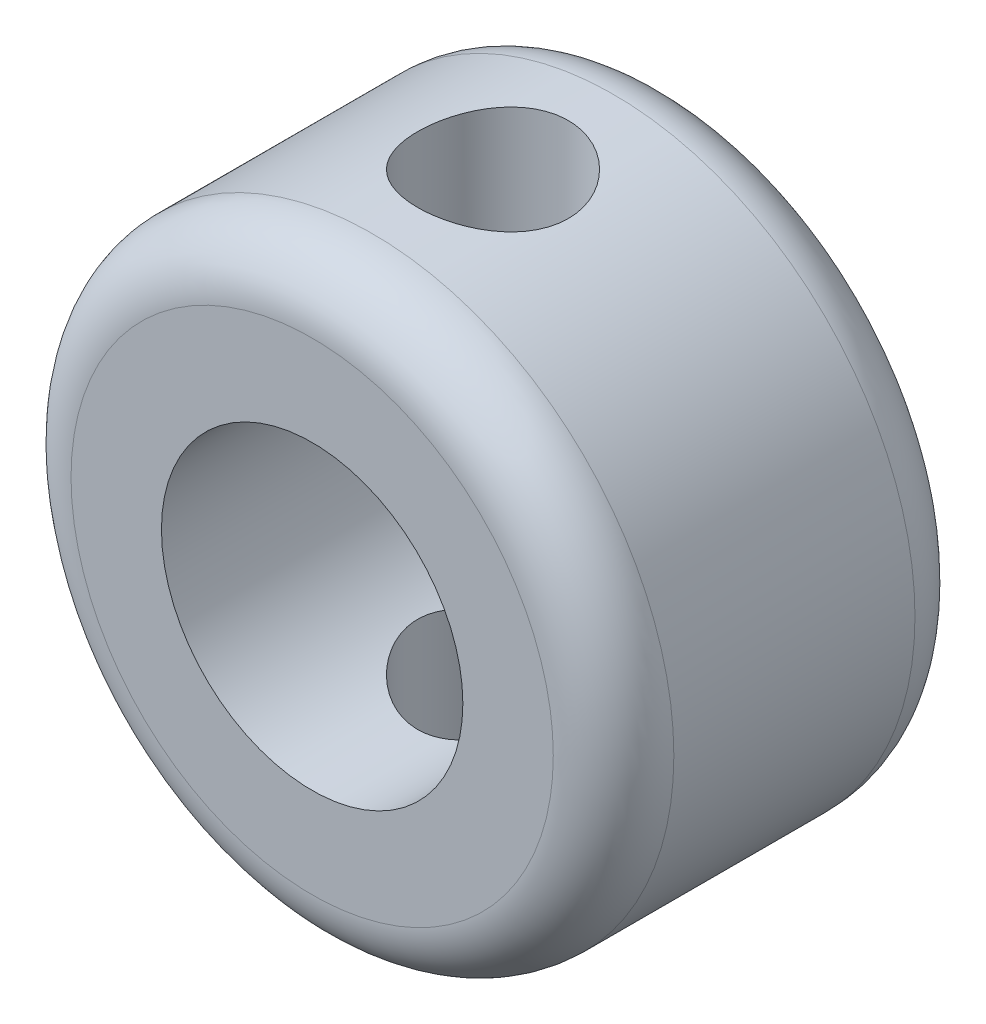
ISO-10303-21;
HEADER;
FILE_DESCRIPTION(('STEP AP214'),'2;1');
FILE_NAME('part.step','',(''),(''),'','','');
FILE_SCHEMA(('AUTOMOTIVE_DESIGN { 1 0 10303 214 1 1 1 1 }'));
ENDSEC;
DATA;
#1=APPLICATION_CONTEXT('core data for automotive mechanical design processes');
#2=APPLICATION_PROTOCOL_DEFINITION('international standard','automotive_design',2000,#1);
#3=PRODUCT_CONTEXT('',#1,'mechanical');
#4=PRODUCT('Part','Part','',(#3));
#5=PRODUCT_RELATED_PRODUCT_CATEGORY('part','',(#4));
#6=PRODUCT_DEFINITION_FORMATION('','',#4);
#7=PRODUCT_DEFINITION_CONTEXT('part definition',#1,'design');
#8=PRODUCT_DEFINITION('design','',#6,#7);
#9=PRODUCT_DEFINITION_SHAPE('','',#8);
#10=(LENGTH_UNIT() NAMED_UNIT(*) SI_UNIT(.MILLI.,.METRE.));
#11=(NAMED_UNIT(*) PLANE_ANGLE_UNIT() SI_UNIT($,.RADIAN.));
#12=(NAMED_UNIT(*) SI_UNIT($,.STERADIAN.) SOLID_ANGLE_UNIT());
#13=UNCERTAINTY_MEASURE_WITH_UNIT(LENGTH_MEASURE(1.E-05),#10,'distance_accuracy_value','');
#14=(GEOMETRIC_REPRESENTATION_CONTEXT(3) GLOBAL_UNCERTAINTY_ASSIGNED_CONTEXT((#13)) GLOBAL_UNIT_ASSIGNED_CONTEXT((#10,
#11,#12)) REPRESENTATION_CONTEXT('',''));
#15=CARTESIAN_POINT('',(0.,0.,0.));
#16=DIRECTION('',(0.,0.,1.));
#17=DIRECTION('',(1.,0.,0.));
#18=AXIS2_PLACEMENT_3D('',#15,#16,#17);
#19=CARTESIAN_POINT('',(0.,0.,6.));
#20=DIRECTION('',(0.,0.,-1.));
#21=DIRECTION('',(-1.,0.,0.));
#22=AXIS2_PLACEMENT_3D('',#19,#20,#21);
#23=CYLINDRICAL_SURFACE('',#22,5.);
#24=CARTESIAN_POINT('',(0.,-5.,4.25));
#25=CARTESIAN_POINT('',(0.069063407224776,-4.99999883223344,4.24999806188487));
#26=CARTESIAN_POINT('',(0.138148464858969,-4.99855481776524,4.24425704102184));
#27=CARTESIAN_POINT('',(0.274338603142111,-4.99293428191577,4.2214790405775));
#28=CARTESIAN_POINT('',(0.341442539058949,-4.98875621183307,4.20443565871846));
#29=CARTESIAN_POINT('',(0.471684060152147,-4.97813021943367,4.15963395544826));
#30=CARTESIAN_POINT('',(0.534826302858336,-4.97168502368406,4.1318885010706));
#31=CARTESIAN_POINT('',(0.655560109920355,-4.95721119839661,4.06651550829597));
#32=CARTESIAN_POINT('',(0.713151486957299,-4.94918251545042,4.02888763656755));
#33=CARTESIAN_POINT('',(0.822334939417433,-4.93222844659835,3.94399934195482));
#34=CARTESIAN_POINT('',(0.873796408384226,-4.92328922623777,3.89657368753402));
#35=CARTESIAN_POINT('',(0.968124106002753,-4.90561350097941,3.79378982924257));
#36=CARTESIAN_POINT('',(1.01098936412428,-4.89687701906957,3.73843073087792));
#37=CARTESIAN_POINT('',(1.08752211899919,-4.88045646416425,3.62033731105214));
#38=CARTESIAN_POINT('',(1.12104351327113,-4.87278995392171,3.55750564099133));
#39=CARTESIAN_POINT('',(1.17699742379211,-4.85957912343519,3.42687632361803));
#40=CARTESIAN_POINT('',(1.19943171286611,-4.85403446393991,3.35907947222853));
#41=CARTESIAN_POINT('',(1.23212903067024,-4.84583730597959,3.2218804181646));
#42=CARTESIAN_POINT('',(1.24262689027778,-4.84312909229522,3.15253758662517));
#43=CARTESIAN_POINT('',(1.25188481255654,-4.84074468781451,3.01302619248835));
#44=CARTESIAN_POINT('',(1.25064678484831,-4.8410680037387,2.94285776608449));
#45=CARTESIAN_POINT('',(1.2366554371994,-4.84466004580515,2.8054868268796));
#46=CARTESIAN_POINT('',(1.22418195015877,-4.84785719168233,2.73825364877909));
#47=CARTESIAN_POINT('',(1.18852015575259,-4.85672258063736,2.60686579090726));
#48=CARTESIAN_POINT('',(1.16533108505785,-4.8623909997558,2.54271133080918));
#49=CARTESIAN_POINT('',(1.10865789828096,-4.87562594920156,2.41855165312328));
#50=CARTESIAN_POINT('',(1.07507222269409,-4.88321106224518,2.35859485684204));
#51=CARTESIAN_POINT('',(0.998630230012462,-4.89941425705322,2.2450677418693));
#52=CARTESIAN_POINT('',(0.955772290674032,-4.90803251945613,2.19149854327729));
#53=CARTESIAN_POINT('',(0.860552853901015,-4.92563233783151,2.090663653588));
#54=CARTESIAN_POINT('',(0.807955215138216,-4.93461724564976,2.04362125828221));
#55=CARTESIAN_POINT('',(0.695509931253083,-4.95171637982322,1.95898229794675));
#56=CARTESIAN_POINT('',(0.63566206475662,-4.95983057957846,1.92138602144703));
#57=CARTESIAN_POINT('',(0.51009657390116,-4.97431443411819,1.85662451147968));
#58=CARTESIAN_POINT('',(0.44435949434052,-4.98067800106438,1.82949554978798));
#59=CARTESIAN_POINT('',(0.309063340119069,-4.99089930826182,1.78673557857536));
#60=CARTESIAN_POINT('',(0.239504999292071,-4.99475752782734,1.77110236965155));
#61=CARTESIAN_POINT('',(0.100449975325022,-4.99946249392812,1.75211869536764));
#62=CARTESIAN_POINT('',(0.0309972666568413,-5.00038377923566,1.74846414493725));
#63=CARTESIAN_POINT('',(-0.107527395667924,-4.99932337345376,1.75270750171291));
#64=CARTESIAN_POINT('',(-0.176599383037163,-4.99734194368205,1.76060436899928));
#65=CARTESIAN_POINT('',(-0.31134522398041,-4.99074650939464,1.78747575699282));
#66=CARTESIAN_POINT('',(-0.377054265807295,-4.98617195154843,1.80628438623082));
#67=CARTESIAN_POINT('',(-0.504381077043759,-4.97490588861778,1.85425590335704));
#68=CARTESIAN_POINT('',(-0.565998432527195,-4.9682141697491,1.88341983692764));
#69=CARTESIAN_POINT('',(-0.684602612024873,-4.95327756605259,1.95186344072894));
#70=CARTESIAN_POINT('',(-0.741487868196525,-4.94500722805777,1.9913134269973));
#71=CARTESIAN_POINT('',(-0.847938844702705,-4.92787090989516,2.07899159066414));
#72=CARTESIAN_POINT('',(-0.897503299144173,-4.91900482709754,2.12722128301409));
#73=CARTESIAN_POINT('',(-0.989158806727275,-4.90140797467309,2.23250163403705));
#74=CARTESIAN_POINT('',(-1.03103655635169,-4.89268586822734,2.28973975250202));
#75=CARTESIAN_POINT('',(-1.10459229917725,-4.87660731981032,2.41061052872143));
#76=CARTESIAN_POINT('',(-1.13627074513161,-4.86925081722522,2.47424290246646));
#77=CARTESIAN_POINT('',(-1.18829285050774,-4.85681745612221,2.60575476867756));
#78=CARTESIAN_POINT('',(-1.20870366387839,-4.85172712743255,2.67360635695334));
#79=CARTESIAN_POINT('',(-1.23778804996148,-4.84438953408486,2.81192469824092));
#80=CARTESIAN_POINT('',(-1.24646418956555,-4.84214164766613,2.88239087586041));
#81=CARTESIAN_POINT('',(-1.25169882527833,-4.84079084336631,3.02176751987934));
#82=CARTESIAN_POINT('',(-1.2485982481501,-4.8415994394022,3.09066452927061));
#83=CARTESIAN_POINT('',(-1.23114773192739,-4.84606590839869,3.22691990722332));
#84=CARTESIAN_POINT('',(-1.21679801890564,-4.84972372409881,3.29427830667804));
#85=CARTESIAN_POINT('',(-1.17744276620233,-4.85942717235602,3.42517371588784));
#86=CARTESIAN_POINT('',(-1.15250117056698,-4.86545846030258,3.48873108770017));
#87=CARTESIAN_POINT('',(-1.09272076133756,-4.87923129770691,3.61080448559474));
#88=CARTESIAN_POINT('',(-1.05788057502849,-4.88697308433977,3.6693198109891));
#89=CARTESIAN_POINT('',(-0.97822312386428,-4.90354695219593,3.78129552416835));
#90=CARTESIAN_POINT('',(-0.933169302426879,-4.91240220693131,3.8345842278533));
#91=CARTESIAN_POINT('',(-0.834824475991446,-4.93006689371905,3.93295587066284));
#92=CARTESIAN_POINT('',(-0.781531517717622,-4.93887631439216,3.97803685842747));
#93=CARTESIAN_POINT('',(-0.667056322252158,-4.95564713039719,4.05950942380384));
#94=CARTESIAN_POINT('',(-0.605748685263656,-4.9635902780489,4.09572884472632));
#95=CARTESIAN_POINT('',(-0.47772171625873,-4.97754104145932,4.15728955245044));
#96=CARTESIAN_POINT('',(-0.41100630286395,-4.98355004333151,4.18263863387378));
#97=CARTESIAN_POINT('',(-0.28700854436956,-4.99206716304618,4.21797652527471));
#98=CARTESIAN_POINT('',(-0.230316809090057,-4.99502154210576,4.22995936921119));
#99=CARTESIAN_POINT('',(-0.11575505961357,-4.9989883769329,4.24597161968495));
#100=CARTESIAN_POINT('',(-0.057885134368847,-5.00000097875745,4.25000162442108));
#101=CARTESIAN_POINT('',(0.,-5.,4.25));
#102=B_SPLINE_CURVE_WITH_KNOTS('',3,(#24,#25,#26,#27,#28,#29,#30,#31,#32,#33,#34,#35,#36,#37,
#38,#39,#40,#41,#42,#43,#44,#45,#46,#47,#48,#49,#50,#51,#52,#53,#54,#55,#56,#57,#58,#59,#60,#61,
#62,#63,#64,#65,#66,#67,#68,#69,#70,#71,#72,#73,#74,#75,#76,#77,#78,#79,#80,#81,#82,#83,#84,#85,
#86,#87,#88,#89,#90,#91,#92,#93,#94,#95,#96,#97,#98,#99,#100,#101),.UNSPECIFIED.,.T.,.F.,(4,2,2,
2,2,2,2,2,2,2,2,2,2,2,2,2,2,2,2,2,2,2,2,2,2,2,2,2,2,2,2,2,2,2,2,2,2,2,4),(0.,0.206978093726575,
0.414073531469916,0.620920751905088,0.827774950141106,1.03845362864282,1.24915607983385,
1.46298872954839,1.6767871764114,1.88630245916192,2.09578365093914,2.30018747505848,
2.50460586221699,2.71108773228233,2.91760575696802,3.13001250807516,3.34242574631873,
3.55556857507595,3.76867061407202,3.97631924124397,4.18394917593952,4.38850228761698,
4.59307606101909,4.80127989637793,5.00951969173349,5.2228709100373,5.4362126562459,
5.6482687884503,5.8602785271034,6.06619816998844,6.27211367463362,6.47680333799539,
6.68152140114085,6.89157980341592,7.10168808142015,7.3156015458299,7.52936136517792,
7.70285202451791,7.876329633692),.UNSPECIFIED.);
#103=CARTESIAN_POINT('',(0.,-5.,4.25));
#104=VERTEX_POINT('',#103);
#105=EDGE_CURVE('E92',#104,#104,#102,.T.);
#106=ORIENTED_EDGE('',*,*,#105,.T.);
#107=EDGE_LOOP('',(#106));
#108=FACE_BOUND('',#107,.T.);
#109=CARTESIAN_POINT('',(0.,5.,4.25));
#110=CARTESIAN_POINT('',(-0.069063407224776,4.99999883223344,4.24999806188487));
#111=CARTESIAN_POINT('',(-0.138148464858969,4.99855481776524,4.24425704102184));
#112=CARTESIAN_POINT('',(-0.274338603142111,4.99293428191577,4.2214790405775));
#113=CARTESIAN_POINT('',(-0.341442539058949,4.98875621183307,4.20443565871846));
#114=CARTESIAN_POINT('',(-0.471684060152147,4.97813021943367,4.15963395544826));
#115=CARTESIAN_POINT('',(-0.534826302858336,4.97168502368406,4.1318885010706));
#116=CARTESIAN_POINT('',(-0.655560109920355,4.95721119839661,4.06651550829597));
#117=CARTESIAN_POINT('',(-0.713151486957299,4.94918251545042,4.02888763656755));
#118=CARTESIAN_POINT('',(-0.822334939417433,4.93222844659835,3.94399934195482));
#119=CARTESIAN_POINT('',(-0.873796408384226,4.92328922623777,3.89657368753402));
#120=CARTESIAN_POINT('',(-0.968124106002753,4.90561350097941,3.79378982924257));
#121=CARTESIAN_POINT('',(-1.01098936412428,4.89687701906957,3.73843073087792));
#122=CARTESIAN_POINT('',(-1.08752211899919,4.88045646416425,3.62033731105214));
#123=CARTESIAN_POINT('',(-1.12104351327113,4.87278995392171,3.55750564099133));
#124=CARTESIAN_POINT('',(-1.17699742379211,4.85957912343519,3.42687632361803));
#125=CARTESIAN_POINT('',(-1.19943171286611,4.85403446393991,3.35907947222853));
#126=CARTESIAN_POINT('',(-1.23212903067024,4.84583730597959,3.2218804181646));
#127=CARTESIAN_POINT('',(-1.24262689027778,4.84312909229522,3.15253758662517));
#128=CARTESIAN_POINT('',(-1.25188481255654,4.84074468781451,3.01302619248835));
#129=CARTESIAN_POINT('',(-1.25064678484831,4.8410680037387,2.94285776608449));
#130=CARTESIAN_POINT('',(-1.2366554371994,4.84466004580515,2.8054868268796));
#131=CARTESIAN_POINT('',(-1.22418195015877,4.84785719168233,2.73825364877909));
#132=CARTESIAN_POINT('',(-1.18852015575259,4.85672258063736,2.60686579090726));
#133=CARTESIAN_POINT('',(-1.16533108505785,4.8623909997558,2.54271133080918));
#134=CARTESIAN_POINT('',(-1.10865789828096,4.87562594920156,2.41855165312328));
#135=CARTESIAN_POINT('',(-1.07507222269409,4.88321106224518,2.35859485684204));
#136=CARTESIAN_POINT('',(-0.998630230012462,4.89941425705322,2.2450677418693));
#137=CARTESIAN_POINT('',(-0.955772290674032,4.90803251945613,2.19149854327729));
#138=CARTESIAN_POINT('',(-0.860552853901015,4.92563233783151,2.090663653588));
#139=CARTESIAN_POINT('',(-0.807955215138216,4.93461724564976,2.04362125828221));
#140=CARTESIAN_POINT('',(-0.695509931253083,4.95171637982322,1.95898229794675));
#141=CARTESIAN_POINT('',(-0.63566206475662,4.95983057957846,1.92138602144703));
#142=CARTESIAN_POINT('',(-0.51009657390116,4.97431443411819,1.85662451147968));
#143=CARTESIAN_POINT('',(-0.44435949434052,4.98067800106438,1.82949554978798));
#144=CARTESIAN_POINT('',(-0.309063340119069,4.99089930826182,1.78673557857536));
#145=CARTESIAN_POINT('',(-0.239504999292071,4.99475752782734,1.77110236965155));
#146=CARTESIAN_POINT('',(-0.100449975325022,4.99946249392812,1.75211869536764));
#147=CARTESIAN_POINT('',(-0.0309972666568413,5.00038377923566,1.74846414493725));
#148=CARTESIAN_POINT('',(0.107527395667924,4.99932337345376,1.75270750171291));
#149=CARTESIAN_POINT('',(0.176599383037163,4.99734194368205,1.76060436899928));
#150=CARTESIAN_POINT('',(0.31134522398041,4.99074650939464,1.78747575699282));
#151=CARTESIAN_POINT('',(0.377054265807295,4.98617195154843,1.80628438623082));
#152=CARTESIAN_POINT('',(0.504381077043759,4.97490588861778,1.85425590335704));
#153=CARTESIAN_POINT('',(0.565998432527195,4.9682141697491,1.88341983692764));
#154=CARTESIAN_POINT('',(0.684602612024873,4.95327756605259,1.95186344072894));
#155=CARTESIAN_POINT('',(0.741487868196525,4.94500722805777,1.9913134269973));
#156=CARTESIAN_POINT('',(0.847938844702705,4.92787090989516,2.07899159066414));
#157=CARTESIAN_POINT('',(0.897503299144173,4.91900482709754,2.12722128301409));
#158=CARTESIAN_POINT('',(0.989158806727275,4.90140797467309,2.23250163403705));
#159=CARTESIAN_POINT('',(1.03103655635169,4.89268586822734,2.28973975250202));
#160=CARTESIAN_POINT('',(1.10459229917725,4.87660731981032,2.41061052872143));
#161=CARTESIAN_POINT('',(1.13627074513161,4.86925081722522,2.47424290246646));
#162=CARTESIAN_POINT('',(1.18829285050774,4.85681745612221,2.60575476867756));
#163=CARTESIAN_POINT('',(1.20870366387839,4.85172712743255,2.67360635695334));
#164=CARTESIAN_POINT('',(1.23778804996148,4.84438953408486,2.81192469824092));
#165=CARTESIAN_POINT('',(1.24646418956555,4.84214164766613,2.88239087586041));
#166=CARTESIAN_POINT('',(1.25169882527833,4.84079084336631,3.02176751987934));
#167=CARTESIAN_POINT('',(1.2485982481501,4.8415994394022,3.09066452927061));
#168=CARTESIAN_POINT('',(1.23114773192739,4.84606590839869,3.22691990722332));
#169=CARTESIAN_POINT('',(1.21679801890564,4.84972372409881,3.29427830667804));
#170=CARTESIAN_POINT('',(1.17744276620233,4.85942717235602,3.42517371588784));
#171=CARTESIAN_POINT('',(1.15250117056698,4.86545846030258,3.48873108770017));
#172=CARTESIAN_POINT('',(1.09272076133756,4.87923129770691,3.61080448559474));
#173=CARTESIAN_POINT('',(1.05788057502849,4.88697308433977,3.6693198109891));
#174=CARTESIAN_POINT('',(0.97822312386428,4.90354695219593,3.78129552416835));
#175=CARTESIAN_POINT('',(0.933169302426879,4.91240220693131,3.8345842278533));
#176=CARTESIAN_POINT('',(0.834824475991446,4.93006689371905,3.93295587066284));
#177=CARTESIAN_POINT('',(0.781531517717622,4.93887631439216,3.97803685842747));
#178=CARTESIAN_POINT('',(0.667056322252158,4.95564713039719,4.05950942380384));
#179=CARTESIAN_POINT('',(0.605748685263656,4.9635902780489,4.09572884472632));
#180=CARTESIAN_POINT('',(0.47772171625873,4.97754104145932,4.15728955245044));
#181=CARTESIAN_POINT('',(0.41100630286395,4.98355004333151,4.18263863387378));
#182=CARTESIAN_POINT('',(0.28700854436956,4.99206716304618,4.21797652527471));
#183=CARTESIAN_POINT('',(0.230316809090057,4.99502154210576,4.22995936921119));
#184=CARTESIAN_POINT('',(0.11575505961357,4.9989883769329,4.24597161968495));
#185=CARTESIAN_POINT('',(0.057885134368847,5.00000097875745,4.25000162442108));
#186=CARTESIAN_POINT('',(0.,5.,4.25));
#187=B_SPLINE_CURVE_WITH_KNOTS('',3,(#109,#110,#111,#112,#113,#114,#115,#116,#117,#118,#119,
#120,#121,#122,#123,#124,#125,#126,#127,#128,#129,#130,#131,#132,#133,#134,#135,#136,#137,#138,
#139,#140,#141,#142,#143,#144,#145,#146,#147,#148,#149,#150,#151,#152,#153,#154,#155,#156,#157,
#158,#159,#160,#161,#162,#163,#164,#165,#166,#167,#168,#169,#170,#171,#172,#173,#174,#175,#176,
#177,#178,#179,#180,#181,#182,#183,#184,#185,#186),.UNSPECIFIED.,.T.,.F.,(4,2,2,2,2,2,2,2,2,2,2,
2,2,2,2,2,2,2,2,2,2,2,2,2,2,2,2,2,2,2,2,2,2,2,2,2,2,2,4),(0.,0.206978093726575,
0.414073531469916,0.620920751905088,0.827774950141106,1.03845362864282,1.24915607983385,
1.46298872954839,1.6767871764114,1.88630245916192,2.09578365093914,2.30018747505848,
2.50460586221699,2.71108773228233,2.91760575696802,3.13001250807516,3.34242574631873,
3.55556857507595,3.76867061407202,3.97631924124397,4.18394917593952,4.38850228761698,
4.59307606101909,4.80127989637793,5.00951969173349,5.2228709100373,5.4362126562459,
5.6482687884503,5.8602785271034,6.06619816998844,6.27211367463362,6.47680333799539,
6.68152140114085,6.89157980341592,7.10168808142015,7.3156015458299,7.52936136517792,
7.70285202451791,7.876329633692),.UNSPECIFIED.);
#188=CARTESIAN_POINT('',(0.,5.,4.25));
#189=VERTEX_POINT('',#188);
#190=EDGE_CURVE('E85',#189,#189,#187,.T.);
#191=ORIENTED_EDGE('',*,*,#190,.T.);
#192=EDGE_LOOP('',(#191));
#193=FACE_BOUND('',#192,.T.);
#194=CARTESIAN_POINT('',(0.,0.,1.));
#195=DIRECTION('',(0.,0.,1.));
#196=DIRECTION('',(1.,0.,0.));
#197=AXIS2_PLACEMENT_3D('',#194,#195,#196);
#198=CIRCLE('',#197,5.);
#199=CARTESIAN_POINT('',(5.,0.,1.));
#200=VERTEX_POINT('',#199);
#201=EDGE_CURVE('E63',#200,#200,#198,.T.);
#202=ORIENTED_EDGE('',*,*,#201,.T.);
#203=EDGE_LOOP('',(#202));
#204=FACE_BOUND('',#203,.T.);
#205=CARTESIAN_POINT('',(0.,0.,5.));
#206=DIRECTION('',(0.,0.,1.));
#207=DIRECTION('',(1.,0.,0.));
#208=AXIS2_PLACEMENT_3D('',#205,#206,#207);
#209=CIRCLE('',#208,5.);
#210=CARTESIAN_POINT('',(5.,0.,5.));
#211=VERTEX_POINT('',#210);
#212=EDGE_CURVE('E119',#211,#211,#209,.F.);
#213=ORIENTED_EDGE('',*,*,#212,.T.);
#214=EDGE_LOOP('',(#213));
#215=FACE_BOUND('',#214,.T.);
#216=ADVANCED_FACE('F43',(#108,#193,#204,#215),#23,.T.);
#217=CARTESIAN_POINT('',(0.,0.,6.));
#218=DIRECTION('',(0.,0.,1.));
#219=DIRECTION('',(1.,0.,0.));
#220=AXIS2_PLACEMENT_3D('',#217,#218,#219);
#221=PLANE('',#220);
#222=CARTESIAN_POINT('',(0.,0.,6.));
#223=DIRECTION('',(0.,0.,1.));
#224=DIRECTION('',(1.,0.,0.));
#225=AXIS2_PLACEMENT_3D('',#222,#223,#224);
#226=CIRCLE('',#225,2.5);
#227=CARTESIAN_POINT('',(2.5,0.,6.));
#228=VERTEX_POINT('',#227);
#229=EDGE_CURVE('E122',#228,#228,#226,.T.);
#230=ORIENTED_EDGE('',*,*,#229,.F.);
#231=EDGE_LOOP('',(#230));
#232=FACE_BOUND('',#231,.T.);
#233=CARTESIAN_POINT('',(0.,0.,6.));
#234=DIRECTION('',(0.,0.,1.));
#235=DIRECTION('',(1.,0.,0.));
#236=AXIS2_PLACEMENT_3D('',#233,#234,#235);
#237=CIRCLE('',#236,4.);
#238=CARTESIAN_POINT('',(4.,0.,6.));
#239=VERTEX_POINT('',#238);
#240=EDGE_CURVE('E10',#239,#239,#237,.T.);
#241=ORIENTED_EDGE('',*,*,#240,.T.);
#242=EDGE_LOOP('',(#241));
#243=FACE_BOUND('',#242,.T.);
#244=ADVANCED_FACE('F100',(#232,#243),#221,.T.);
#245=CARTESIAN_POINT('',(0.,0.,0.));
#246=DIRECTION('',(0.,0.,1.));
#247=DIRECTION('',(1.,0.,0.));
#248=AXIS2_PLACEMENT_3D('',#245,#246,#247);
#249=PLANE('',#248);
#250=CARTESIAN_POINT('',(0.,0.,0.));
#251=DIRECTION('',(0.,0.,1.));
#252=DIRECTION('',(1.,0.,0.));
#253=AXIS2_PLACEMENT_3D('',#250,#251,#252);
#254=CIRCLE('',#253,2.5);
#255=CARTESIAN_POINT('',(2.5,0.,0.));
#256=VERTEX_POINT('',#255);
#257=EDGE_CURVE('E127',#256,#256,#254,.T.);
#258=ORIENTED_EDGE('',*,*,#257,.T.);
#259=EDGE_LOOP('',(#258));
#260=FACE_BOUND('',#259,.T.);
#261=CARTESIAN_POINT('',(0.,0.,0.));
#262=DIRECTION('',(0.,0.,1.));
#263=DIRECTION('',(1.,0.,0.));
#264=AXIS2_PLACEMENT_3D('',#261,#262,#263);
#265=CIRCLE('',#264,4.);
#266=CARTESIAN_POINT('',(4.,0.,0.));
#267=VERTEX_POINT('',#266);
#268=EDGE_CURVE('E57',#267,#267,#265,.F.);
#269=ORIENTED_EDGE('',*,*,#268,.T.);
#270=EDGE_LOOP('',(#269));
#271=FACE_BOUND('',#270,.T.);
#272=ADVANCED_FACE('F102',(#260,#271),#249,.F.);
#273=CARTESIAN_POINT('',(0.,0.,1.));
#274=DIRECTION('',(0.,0.,1.));
#275=DIRECTION('',(1.,0.,0.));
#276=AXIS2_PLACEMENT_3D('',#273,#274,#275);
#277=TOROIDAL_SURFACE('',#276,4.,1.);
#278=ORIENTED_EDGE('',*,*,#268,.F.);
#279=EDGE_LOOP('',(#278));
#280=FACE_BOUND('',#279,.T.);
#281=ORIENTED_EDGE('',*,*,#201,.F.);
#282=EDGE_LOOP('',(#281));
#283=FACE_BOUND('',#282,.T.);
#284=ADVANCED_FACE('F103',(#280,#283),#277,.T.);
#285=CARTESIAN_POINT('',(0.,0.,5.));
#286=DIRECTION('',(0.,0.,1.));
#287=DIRECTION('',(1.,0.,0.));
#288=AXIS2_PLACEMENT_3D('',#285,#286,#287);
#289=TOROIDAL_SURFACE('',#288,4.,1.);
#290=ORIENTED_EDGE('',*,*,#212,.F.);
#291=EDGE_LOOP('',(#290));
#292=FACE_BOUND('',#291,.T.);
#293=ORIENTED_EDGE('',*,*,#240,.F.);
#294=EDGE_LOOP('',(#293));
#295=FACE_BOUND('',#294,.T.);
#296=ADVANCED_FACE('F45',(#292,#295),#289,.T.);
#297=CARTESIAN_POINT('',(0.,0.,0.));
#298=DIRECTION('',(0.,0.,1.));
#299=DIRECTION('',(1.,0.,0.));
#300=AXIS2_PLACEMENT_3D('',#297,#298,#299);
#301=CYLINDRICAL_SURFACE('',#300,2.5);
#302=CARTESIAN_POINT('',(0.,-2.5,4.25));
#303=CARTESIAN_POINT('',(-0.065714953691233,-2.49999641755189,4.24999587210062));
#304=CARTESIAN_POINT('',(-0.131508249622541,-2.49738113774397,4.24478740859791));
#305=CARTESIAN_POINT('',(-0.261150294085531,-2.48717695046745,4.22418389957385));
#306=CARTESIAN_POINT('',(-0.32499510839188,-2.47957859786229,4.20876950875294));
#307=CARTESIAN_POINT('',(-0.448666931100718,-2.46020349254139,4.16850773922901));
#308=CARTESIAN_POINT('',(-0.508508503673975,-2.448442989719,4.14369701968999));
#309=CARTESIAN_POINT('',(-0.623090771008206,-2.42182220644723,4.08553672329382));
#310=CARTESIAN_POINT('',(-0.677831867487562,-2.40696217041913,4.05218781968893));
#311=CARTESIAN_POINT('',(-0.784384772202399,-2.37445322822571,3.97560343814338));
#312=CARTESIAN_POINT('',(-0.83581901390264,-2.3566899890942,3.93189190095045));
#313=CARTESIAN_POINT('',(-0.930974306083722,-2.3207496280843,3.83684815094121));
#314=CARTESIAN_POINT('',(-0.974689478883458,-2.30257220261294,3.78551018528445));
#315=CARTESIAN_POINT('',(-1.05656500056285,-2.26623688996684,3.67189581309577));
#316=CARTESIAN_POINT('',(-1.09403166943955,-2.24818983712665,3.60907987706761));
#317=CARTESIAN_POINT('',(-1.15771028361337,-2.21607473465401,3.47704083001723));
#318=CARTESIAN_POINT('',(-1.18393026870792,-2.20200384508737,3.40782233909656));
#319=CARTESIAN_POINT('',(-1.22266555273574,-2.18072333797261,3.2691686182226));
#320=CARTESIAN_POINT('',(-1.23590732135055,-2.17315339479642,3.19999443491576));
#321=CARTESIAN_POINT('',(-1.25053374163606,-2.1647736243566,3.06002645277565));
#322=CARTESIAN_POINT('',(-1.25193011046634,-2.1639571167911,2.98923432391106));
#323=CARTESIAN_POINT('',(-1.24335910896537,-2.16888662821561,2.85714246960579));
#324=CARTESIAN_POINT('',(-1.23473069942103,-2.17385954577517,2.79571996097119));
#325=CARTESIAN_POINT('',(-1.20867481132117,-2.18845285917313,2.6753476132837));
#326=CARTESIAN_POINT('',(-1.19124452987206,-2.1980747353972,2.61639856836836));
#327=CARTESIAN_POINT('',(-1.1477622254825,-2.22109345515926,2.50096358429293));
#328=CARTESIAN_POINT('',(-1.12151883389499,-2.23457300829998,2.44456700151776));
#329=CARTESIAN_POINT('',(-1.061302109585,-2.26379255351755,2.33670713426249));
#330=CARTESIAN_POINT('',(-1.02732530476558,-2.27953355975238,2.28524608049989));
#331=CARTESIAN_POINT('',(-0.947582568640986,-2.31391447379107,2.18184843407097));
#332=CARTESIAN_POINT('',(-0.900868072961602,-2.33266887795933,2.1306789080298));
#333=CARTESIAN_POINT('',(-0.799444473426717,-2.36934529125509,2.03658072676137));
#334=CARTESIAN_POINT('',(-0.744731570717857,-2.38726689948501,1.99365600995765));
#335=CARTESIAN_POINT('',(-0.625645632289811,-2.42127484103705,1.91539292371284));
#336=CARTESIAN_POINT('',(-0.560941989499261,-2.43723730202509,1.88049940944282));
#337=CARTESIAN_POINT('',(-0.425582769360996,-2.46447351401553,1.82237871369624));
#338=CARTESIAN_POINT('',(-0.354931970331596,-2.47575098679441,1.79914226873104));
#339=CARTESIAN_POINT('',(-0.215958114575877,-2.49155417176795,1.76690574535416));
#340=CARTESIAN_POINT('',(-0.147926913185405,-2.4965617287664,1.75688595531653));
#341=CARTESIAN_POINT('',(-0.0109744999366917,-2.50091266823877,1.74816908608189));
#342=CARTESIAN_POINT('',(0.057946274837377,-2.5002587340164,1.74946664295065));
#343=CARTESIAN_POINT('',(0.189041214982492,-2.49363990316801,1.76275836052344));
#344=CARTESIAN_POINT('',(0.251324260062443,-2.48809057110237,1.77391566591254));
#345=CARTESIAN_POINT('',(0.373008615377396,-2.47277714143524,1.80529758986886));
#346=CARTESIAN_POINT('',(0.432409607113746,-2.46301257917916,1.8255232080667));
#347=CARTESIAN_POINT('',(0.548610760562082,-2.43980314267087,1.87499808304147));
#348=CARTESIAN_POINT('',(0.605287996257692,-2.42626102212424,1.90448881264602));
#349=CARTESIAN_POINT('',(0.713076702123652,-2.39679967896386,1.97138441955755));
#350=CARTESIAN_POINT('',(0.764185787219103,-2.38087944457231,2.00879266824179));
#351=CARTESIAN_POINT('',(0.864709611613317,-2.3463527667183,2.09470053166609));
#352=CARTESIAN_POINT('',(0.913465097280799,-2.32763606060552,2.14392858556696));
#353=CARTESIAN_POINT('',(1.00232040139155,-2.29077989504843,2.24990643908663));
#354=CARTESIAN_POINT('',(1.04241423211355,-2.27264084226908,2.30666139852047));
#355=CARTESIAN_POINT('',(1.11463489312212,-2.23813990282585,2.42955456775039));
#356=CARTESIAN_POINT('',(1.1462818698483,-2.2219066207934,2.49601408276074));
#357=CARTESIAN_POINT('',(1.19760353251725,-2.19467590460158,2.63438758461565));
#358=CARTESIAN_POINT('',(1.21729364485946,-2.18367172800773,2.70629440812648));
#359=CARTESIAN_POINT('',(1.2423271093121,-2.16951876260833,2.84613777857681));
#360=CARTESIAN_POINT('',(1.24886624550108,-2.16571729325614,2.9137928167863));
#361=CARTESIAN_POINT('',(1.25086144297598,-2.16456693307719,3.04930883396341));
#362=CARTESIAN_POINT('',(1.2463223082805,-2.16721524534441,3.11716971092429));
#363=CARTESIAN_POINT('',(1.22740765699033,-2.17797327562531,3.24435437691502));
#364=CARTESIAN_POINT('',(1.2140103929285,-2.18553868102992,3.3038755876805));
#365=CARTESIAN_POINT('',(1.17896919778081,-2.20463770234897,3.41976014928088));
#366=CARTESIAN_POINT('',(1.15732261394976,-2.21617259462095,3.47612247761496));
#367=CARTESIAN_POINT('',(1.10476968162585,-2.2428566295566,3.58828106373326));
#368=CARTESIAN_POINT('',(1.07333892227057,-2.25819652995238,3.64378487728713));
#369=CARTESIAN_POINT('',(1.00268871454579,-2.29044164543238,3.74909317022573));
#370=CARTESIAN_POINT('',(0.96346521404831,-2.30734767243153,3.79889466314811));
#371=CARTESIAN_POINT('',(0.872754158330802,-2.34327903949141,3.89767747794702));
#372=CARTESIAN_POINT('',(0.820355528762714,-2.36231229139336,3.9458238779524));
#373=CARTESIAN_POINT('',(0.707693507775349,-2.3984719031886,4.03282872927954));
#374=CARTESIAN_POINT('',(0.647425904070981,-2.4155972326005,4.07168217428286));
#375=CARTESIAN_POINT('',(0.519914496024933,-2.44622511981379,4.13904545345276));
#376=CARTESIAN_POINT('',(0.452624379918268,-2.45970120703636,4.16748021176429));
#377=CARTESIAN_POINT('',(0.313427626617739,-2.48126676704332,4.21226020989869));
#378=CARTESIAN_POINT('',(0.241534749528957,-2.48937154216165,4.22863980853697));
#379=CARTESIAN_POINT('',(0.140752433104229,-2.49619327387079,4.24237176384481));
#380=CARTESIAN_POINT('',(0.112702349299373,-2.49761706674002,4.24522830107952));
#381=CARTESIAN_POINT('',(0.056439664758947,-2.49952121222331,4.24904333189601));
#382=CARTESIAN_POINT('',(0.0282270595592267,-2.50000153879704,4.250001773089));
#383=CARTESIAN_POINT('',(0.,-2.5,4.25));
#384=B_SPLINE_CURVE_WITH_KNOTS('',3,(#302,#303,#304,#305,#306,#307,#308,#309,#310,#311,#312,
#313,#314,#315,#316,#317,#318,#319,#320,#321,#322,#323,#324,#325,#326,#327,#328,#329,#330,#331,
#332,#333,#334,#335,#336,#337,#338,#339,#340,#341,#342,#343,#344,#345,#346,#347,#348,#349,#350,
#351,#352,#353,#354,#355,#356,#357,#358,#359,#360,#361,#362,#363,#364,#365,#366,#367,#368,#369,
#370,#371,#372,#373,#374,#375,#376,#377,#378,#379,#380,#381,#382,#383),.UNSPECIFIED.,.T.,.F.,(4,
2,2,2,2,2,2,2,2,2,2,2,2,2,2,2,2,2,2,2,2,2,2,2,2,2,2,2,2,2,2,2,2,2,2,2,2,2,2,2,4),(0.,
0.197030321775365,0.394435187136497,0.591077694365373,0.78770470072696,0.996227198397611,
1.20490779706754,1.42977158038441,1.65447434872851,1.86572515175287,2.07676696661276,
2.26257140511651,2.44843504907098,2.63862800210609,2.82890651575277,3.04331176667348,
3.25781918248358,3.48228777768051,3.7065777114035,3.91229113089182,4.11790705639345,
4.30758633132653,4.49728652038664,4.69241070034873,4.88761813435424,5.10199513305524,
5.3165198576929,5.54143352699593,5.76605639925972,5.96911634372967,6.17208824825007,
6.35572412805228,6.53941910979598,6.73545570969518,6.93159451423697,7.15156553440623,
7.37165479220716,7.59330017078657,7.81431135781163,7.89894100172122,7.98357298143559),.UNSPECIFIED.);
#385=CARTESIAN_POINT('',(0.,-2.5,4.25));
#386=VERTEX_POINT('',#385);
#387=EDGE_CURVE('E47',#386,#386,#384,.T.);
#388=ORIENTED_EDGE('',*,*,#387,.T.);
#389=EDGE_LOOP('',(#388));
#390=FACE_BOUND('',#389,.T.);
#391=CARTESIAN_POINT('',(0.,2.5,4.25));
#392=CARTESIAN_POINT('',(0.065714953691233,2.49999641755189,4.24999587210062));
#393=CARTESIAN_POINT('',(0.131508249622541,2.49738113774397,4.24478740859791));
#394=CARTESIAN_POINT('',(0.261150294085531,2.48717695046745,4.22418389957385));
#395=CARTESIAN_POINT('',(0.32499510839188,2.47957859786229,4.20876950875294));
#396=CARTESIAN_POINT('',(0.448666931100718,2.46020349254139,4.16850773922901));
#397=CARTESIAN_POINT('',(0.508508503673975,2.448442989719,4.14369701968999));
#398=CARTESIAN_POINT('',(0.623090771008206,2.42182220644723,4.08553672329382));
#399=CARTESIAN_POINT('',(0.677831867487562,2.40696217041913,4.05218781968893));
#400=CARTESIAN_POINT('',(0.784384772202399,2.37445322822571,3.97560343814338));
#401=CARTESIAN_POINT('',(0.83581901390264,2.3566899890942,3.93189190095045));
#402=CARTESIAN_POINT('',(0.930974306083722,2.3207496280843,3.83684815094121));
#403=CARTESIAN_POINT('',(0.974689478883458,2.30257220261294,3.78551018528445));
#404=CARTESIAN_POINT('',(1.05656500056285,2.26623688996684,3.67189581309577));
#405=CARTESIAN_POINT('',(1.09403166943955,2.24818983712665,3.60907987706761));
#406=CARTESIAN_POINT('',(1.15771028361337,2.21607473465401,3.47704083001723));
#407=CARTESIAN_POINT('',(1.18393026870792,2.20200384508737,3.40782233909656));
#408=CARTESIAN_POINT('',(1.22266555273574,2.18072333797261,3.2691686182226));
#409=CARTESIAN_POINT('',(1.23590732135055,2.17315339479642,3.19999443491576));
#410=CARTESIAN_POINT('',(1.25053374163606,2.1647736243566,3.06002645277565));
#411=CARTESIAN_POINT('',(1.25193011046634,2.1639571167911,2.98923432391106));
#412=CARTESIAN_POINT('',(1.24335910896537,2.16888662821561,2.85714246960579));
#413=CARTESIAN_POINT('',(1.23473069942103,2.17385954577517,2.79571996097119));
#414=CARTESIAN_POINT('',(1.20867481132117,2.18845285917313,2.6753476132837));
#415=CARTESIAN_POINT('',(1.19124452987206,2.1980747353972,2.61639856836836));
#416=CARTESIAN_POINT('',(1.1477622254825,2.22109345515926,2.50096358429293));
#417=CARTESIAN_POINT('',(1.12151883389499,2.23457300829998,2.44456700151776));
#418=CARTESIAN_POINT('',(1.061302109585,2.26379255351755,2.33670713426249));
#419=CARTESIAN_POINT('',(1.02732530476558,2.27953355975238,2.28524608049989));
#420=CARTESIAN_POINT('',(0.947582568640986,2.31391447379107,2.18184843407097));
#421=CARTESIAN_POINT('',(0.900868072961602,2.33266887795933,2.1306789080298));
#422=CARTESIAN_POINT('',(0.799444473426717,2.36934529125509,2.03658072676137));
#423=CARTESIAN_POINT('',(0.744731570717857,2.38726689948501,1.99365600995765));
#424=CARTESIAN_POINT('',(0.625645632289811,2.42127484103705,1.91539292371284));
#425=CARTESIAN_POINT('',(0.560941989499261,2.43723730202509,1.88049940944282));
#426=CARTESIAN_POINT('',(0.425582769360996,2.46447351401553,1.82237871369624));
#427=CARTESIAN_POINT('',(0.354931970331596,2.47575098679441,1.79914226873104));
#428=CARTESIAN_POINT('',(0.215958114575877,2.49155417176795,1.76690574535416));
#429=CARTESIAN_POINT('',(0.147926913185405,2.4965617287664,1.75688595531653));
#430=CARTESIAN_POINT('',(0.0109744999366917,2.50091266823877,1.74816908608189));
#431=CARTESIAN_POINT('',(-0.057946274837377,2.5002587340164,1.74946664295065));
#432=CARTESIAN_POINT('',(-0.189041214982492,2.49363990316801,1.76275836052344));
#433=CARTESIAN_POINT('',(-0.251324260062443,2.48809057110237,1.77391566591254));
#434=CARTESIAN_POINT('',(-0.373008615377396,2.47277714143524,1.80529758986886));
#435=CARTESIAN_POINT('',(-0.432409607113746,2.46301257917916,1.8255232080667));
#436=CARTESIAN_POINT('',(-0.548610760562082,2.43980314267087,1.87499808304147));
#437=CARTESIAN_POINT('',(-0.605287996257692,2.42626102212424,1.90448881264602));
#438=CARTESIAN_POINT('',(-0.713076702123652,2.39679967896386,1.97138441955755));
#439=CARTESIAN_POINT('',(-0.764185787219103,2.38087944457231,2.00879266824179));
#440=CARTESIAN_POINT('',(-0.864709611613317,2.3463527667183,2.09470053166609));
#441=CARTESIAN_POINT('',(-0.913465097280799,2.32763606060552,2.14392858556696));
#442=CARTESIAN_POINT('',(-1.00232040139155,2.29077989504843,2.24990643908663));
#443=CARTESIAN_POINT('',(-1.04241423211355,2.27264084226908,2.30666139852047));
#444=CARTESIAN_POINT('',(-1.11463489312212,2.23813990282585,2.42955456775039));
#445=CARTESIAN_POINT('',(-1.1462818698483,2.2219066207934,2.49601408276074));
#446=CARTESIAN_POINT('',(-1.19760353251725,2.19467590460158,2.63438758461565));
#447=CARTESIAN_POINT('',(-1.21729364485946,2.18367172800773,2.70629440812648));
#448=CARTESIAN_POINT('',(-1.2423271093121,2.16951876260833,2.84613777857681));
#449=CARTESIAN_POINT('',(-1.24886624550108,2.16571729325614,2.9137928167863));
#450=CARTESIAN_POINT('',(-1.25086144297598,2.16456693307719,3.04930883396341));
#451=CARTESIAN_POINT('',(-1.2463223082805,2.16721524534441,3.11716971092429));
#452=CARTESIAN_POINT('',(-1.22740765699033,2.17797327562531,3.24435437691502));
#453=CARTESIAN_POINT('',(-1.2140103929285,2.18553868102992,3.3038755876805));
#454=CARTESIAN_POINT('',(-1.17896919778081,2.20463770234897,3.41976014928088));
#455=CARTESIAN_POINT('',(-1.15732261394976,2.21617259462095,3.47612247761496));
#456=CARTESIAN_POINT('',(-1.10476968162585,2.2428566295566,3.58828106373326));
#457=CARTESIAN_POINT('',(-1.07333892227057,2.25819652995238,3.64378487728713));
#458=CARTESIAN_POINT('',(-1.00268871454579,2.29044164543238,3.74909317022573));
#459=CARTESIAN_POINT('',(-0.96346521404831,2.30734767243153,3.79889466314811));
#460=CARTESIAN_POINT('',(-0.872754158330802,2.34327903949141,3.89767747794702));
#461=CARTESIAN_POINT('',(-0.820355528762714,2.36231229139336,3.9458238779524));
#462=CARTESIAN_POINT('',(-0.707693507775349,2.3984719031886,4.03282872927954));
#463=CARTESIAN_POINT('',(-0.647425904070981,2.4155972326005,4.07168217428286));
#464=CARTESIAN_POINT('',(-0.519914496024933,2.44622511981379,4.13904545345276));
#465=CARTESIAN_POINT('',(-0.452624379918268,2.45970120703636,4.16748021176429));
#466=CARTESIAN_POINT('',(-0.313427626617739,2.48126676704332,4.21226020989869));
#467=CARTESIAN_POINT('',(-0.241534749528957,2.48937154216165,4.22863980853697));
#468=CARTESIAN_POINT('',(-0.140752433104229,2.49619327387079,4.24237176384481));
#469=CARTESIAN_POINT('',(-0.112702349299373,2.49761706674002,4.24522830107952));
#470=CARTESIAN_POINT('',(-0.056439664758947,2.49952121222331,4.24904333189601));
#471=CARTESIAN_POINT('',(-0.0282270595592267,2.50000153879704,4.250001773089));
#472=CARTESIAN_POINT('',(0.,2.5,4.25));
#473=B_SPLINE_CURVE_WITH_KNOTS('',3,(#391,#392,#393,#394,#395,#396,#397,#398,#399,#400,#401,
#402,#403,#404,#405,#406,#407,#408,#409,#410,#411,#412,#413,#414,#415,#416,#417,#418,#419,#420,
#421,#422,#423,#424,#425,#426,#427,#428,#429,#430,#431,#432,#433,#434,#435,#436,#437,#438,#439,
#440,#441,#442,#443,#444,#445,#446,#447,#448,#449,#450,#451,#452,#453,#454,#455,#456,#457,#458,
#459,#460,#461,#462,#463,#464,#465,#466,#467,#468,#469,#470,#471,#472),.UNSPECIFIED.,.T.,.F.,(4,
2,2,2,2,2,2,2,2,2,2,2,2,2,2,2,2,2,2,2,2,2,2,2,2,2,2,2,2,2,2,2,2,2,2,2,2,2,2,2,4),(0.,
0.197030321775365,0.394435187136497,0.591077694365373,0.78770470072696,0.996227198397611,
1.20490779706754,1.42977158038441,1.65447434872851,1.86572515175287,2.07676696661276,
2.26257140511651,2.44843504907098,2.63862800210609,2.82890651575277,3.04331176667348,
3.25781918248358,3.48228777768051,3.7065777114035,3.91229113089182,4.11790705639345,
4.30758633132653,4.49728652038664,4.69241070034873,4.88761813435424,5.10199513305524,
5.3165198576929,5.54143352699593,5.76605639925972,5.96911634372967,6.17208824825007,
6.35572412805228,6.53941910979598,6.73545570969518,6.93159451423697,7.15156553440623,
7.37165479220716,7.59330017078657,7.81431135781163,7.89894100172122,7.98357298143559),.UNSPECIFIED.);
#474=CARTESIAN_POINT('',(0.,2.5,4.25));
#475=VERTEX_POINT('',#474);
#476=EDGE_CURVE('E66',#475,#475,#473,.T.);
#477=ORIENTED_EDGE('',*,*,#476,.T.);
#478=EDGE_LOOP('',(#477));
#479=FACE_BOUND('',#478,.T.);
#480=ORIENTED_EDGE('',*,*,#229,.T.);
#481=EDGE_LOOP('',(#480));
#482=FACE_BOUND('',#481,.T.);
#483=ORIENTED_EDGE('',*,*,#257,.F.);
#484=EDGE_LOOP('',(#483));
#485=FACE_BOUND('',#484,.T.);
#486=ADVANCED_FACE('F72',(#390,#479,#482,#485),#301,.F.);
#487=CARTESIAN_POINT('',(0.,-5.,3.));
#488=DIRECTION('',(0.,1.,0.));
#489=DIRECTION('',(0.,0.,1.));
#490=AXIS2_PLACEMENT_3D('',#487,#488,#489);
#491=CYLINDRICAL_SURFACE('',#490,1.25);
#492=ORIENTED_EDGE('',*,*,#476,.F.);
#493=EDGE_LOOP('',(#492));
#494=FACE_BOUND('',#493,.T.);
#495=ORIENTED_EDGE('',*,*,#190,.F.);
#496=EDGE_LOOP('',(#495));
#497=FACE_BOUND('',#496,.T.);
#498=ADVANCED_FACE('F78',(#494,#497),#491,.F.);
#499=ORIENTED_EDGE('',*,*,#387,.F.);
#500=EDGE_LOOP('',(#499));
#501=FACE_BOUND('',#500,.T.);
#502=ORIENTED_EDGE('',*,*,#105,.F.);
#503=EDGE_LOOP('',(#502));
#504=FACE_BOUND('',#503,.T.);
#505=ADVANCED_FACE('F75',(#501,#504),#491,.F.);
#506=CLOSED_SHELL('',(#216,#244,#272,#284,#296,#486,#498,#505));
#507=MANIFOLD_SOLID_BREP('B2',#506);
#508=ADVANCED_BREP_SHAPE_REPRESENTATION('',(#18,#507),#14);
#509=SHAPE_DEFINITION_REPRESENTATION(#9,#508);
ENDSEC;
END-ISO-10303-21;
